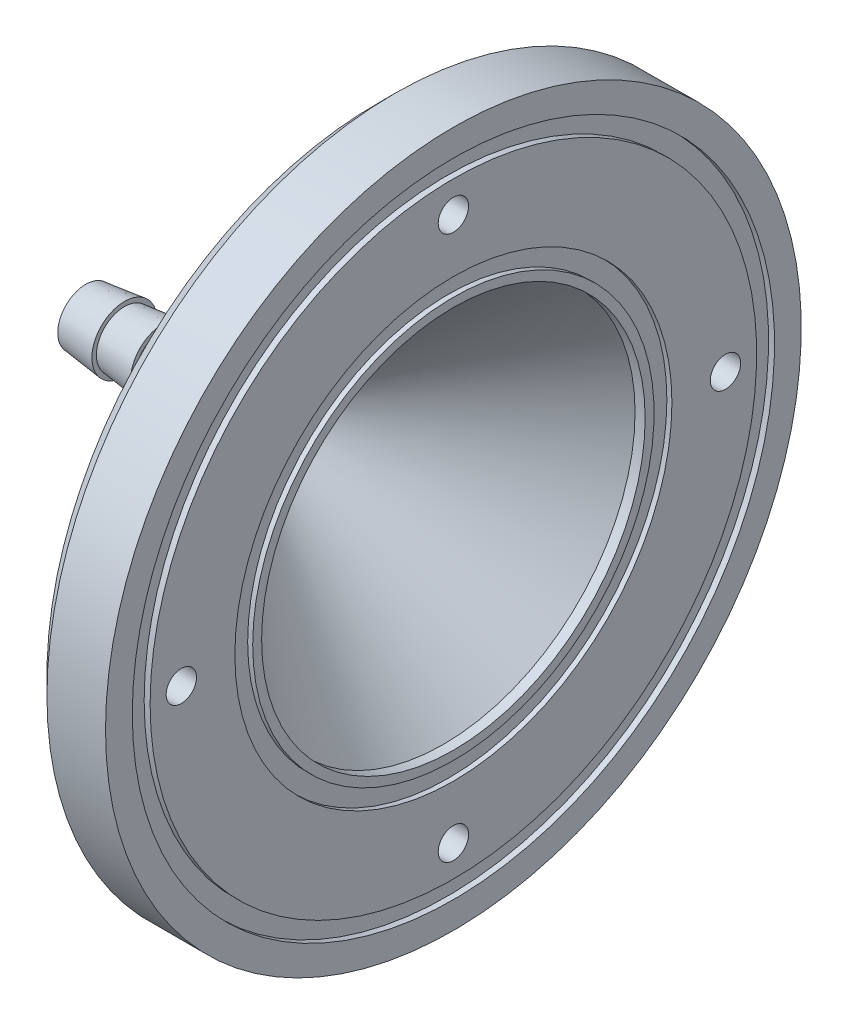
ISO-10303-21;
HEADER;
FILE_DESCRIPTION(('STEP AP214'),'2;1');
FILE_NAME('part.step','',(''),(''),'','','');
FILE_SCHEMA(('AUTOMOTIVE_DESIGN { 1 0 10303 214 1 1 1 1 }'));
ENDSEC;
DATA;
#1=APPLICATION_CONTEXT('core data for automotive mechanical design processes');
#2=APPLICATION_PROTOCOL_DEFINITION('international standard','automotive_design',2000,#1);
#3=PRODUCT_CONTEXT('',#1,'mechanical');
#4=PRODUCT('Part','Part','',(#3));
#5=PRODUCT_RELATED_PRODUCT_CATEGORY('part','',(#4));
#6=PRODUCT_DEFINITION_FORMATION('','',#4);
#7=PRODUCT_DEFINITION_CONTEXT('part definition',#1,'design');
#8=PRODUCT_DEFINITION('design','',#6,#7);
#9=PRODUCT_DEFINITION_SHAPE('','',#8);
#10=(LENGTH_UNIT() NAMED_UNIT(*) SI_UNIT(.MILLI.,.METRE.));
#11=(NAMED_UNIT(*) PLANE_ANGLE_UNIT() SI_UNIT($,.RADIAN.));
#12=(NAMED_UNIT(*) SI_UNIT($,.STERADIAN.) SOLID_ANGLE_UNIT());
#13=UNCERTAINTY_MEASURE_WITH_UNIT(LENGTH_MEASURE(1.E-05),#10,'distance_accuracy_value','');
#14=(GEOMETRIC_REPRESENTATION_CONTEXT(3) GLOBAL_UNCERTAINTY_ASSIGNED_CONTEXT((#13)) GLOBAL_UNIT_ASSIGNED_CONTEXT((#10,
#11,#12)) REPRESENTATION_CONTEXT('',''));
#15=CARTESIAN_POINT('',(0.,0.,0.));
#16=DIRECTION('',(0.,0.,1.));
#17=DIRECTION('',(1.,0.,0.));
#18=AXIS2_PLACEMENT_3D('',#15,#16,#17);
#19=CARTESIAN_POINT('',(22.0301153495263,0.,0.));
#20=DIRECTION('',(1.,0.,0.));
#21=DIRECTION('',(0.,0.,-1.));
#22=AXIS2_PLACEMENT_3D('',#19,#20,#21);
#23=PLANE('',#22);
#24=CARTESIAN_POINT('',(22.0301153495264,0.,0.));
#25=DIRECTION('',(-1.,0.,0.));
#26=DIRECTION('',(0.,0.,1.));
#27=AXIS2_PLACEMENT_3D('',#24,#25,#26);
#28=CIRCLE('',#27,34.);
#29=CARTESIAN_POINT('',(22.0301153495264,0.,34.));
#30=VERTEX_POINT('',#29);
#31=EDGE_CURVE('E115',#30,#30,#28,.T.);
#32=ORIENTED_EDGE('',*,*,#31,.T.);
#33=EDGE_LOOP('',(#32));
#34=FACE_BOUND('',#33,.T.);
#35=CARTESIAN_POINT('',(22.0301153495264,0.,0.));
#36=DIRECTION('',(-1.,0.,0.));
#37=DIRECTION('',(0.,0.,1.));
#38=AXIS2_PLACEMENT_3D('',#35,#36,#37);
#39=CIRCLE('',#38,36.);
#40=CARTESIAN_POINT('',(22.0301153495264,0.,36.));
#41=VERTEX_POINT('',#40);
#42=EDGE_CURVE('E55',#41,#41,#39,.T.);
#43=ORIENTED_EDGE('',*,*,#42,.F.);
#44=EDGE_LOOP('',(#43));
#45=FACE_BOUND('',#44,.T.);
#46=ADVANCED_FACE('F43',(#34,#45),#23,.T.);
#47=CARTESIAN_POINT('',(-801.920554309434,0.,0.));
#48=DIRECTION('',(-1.,0.,0.));
#49=DIRECTION('',(0.,0.,1.));
#50=AXIS2_PLACEMENT_3D('',#47,#48,#49);
#51=CYLINDRICAL_SURFACE('',#50,36.);
#52=CARTESIAN_POINT('',(22.6971153495263,0.,0.));
#53=DIRECTION('',(-1.,0.,0.));
#54=DIRECTION('',(0.,0.,1.));
#55=AXIS2_PLACEMENT_3D('',#52,#53,#54);
#56=CIRCLE('',#55,36.);
#57=CARTESIAN_POINT('',(22.6971153495263,0.,36.));
#58=VERTEX_POINT('',#57);
#59=EDGE_CURVE('E59',#58,#58,#56,.T.);
#60=ORIENTED_EDGE('',*,*,#59,.F.);
#61=EDGE_LOOP('',(#60));
#62=FACE_BOUND('',#61,.T.);
#63=ORIENTED_EDGE('',*,*,#42,.T.);
#64=EDGE_LOOP('',(#63));
#65=FACE_BOUND('',#64,.T.);
#66=ADVANCED_FACE('F237',(#62,#65),#51,.F.);
#67=CARTESIAN_POINT('',(22.6971153495264,0.,0.));
#68=DIRECTION('',(-1.,0.,0.));
#69=DIRECTION('',(0.,0.,1.));
#70=AXIS2_PLACEMENT_3D('',#67,#68,#69);
#71=PLANE('',#70);
#72=CARTESIAN_POINT('',(22.6971153495263,0.,0.));
#73=DIRECTION('',(-1.,0.,0.));
#74=DIRECTION('',(0.,0.,1.));
#75=AXIS2_PLACEMENT_3D('',#72,#73,#74);
#76=CIRCLE('',#75,39.);
#77=CARTESIAN_POINT('',(22.6971153495263,0.,39.));
#78=VERTEX_POINT('',#77);
#79=EDGE_CURVE('E64',#78,#78,#76,.T.);
#80=ORIENTED_EDGE('',*,*,#79,.F.);
#81=EDGE_LOOP('',(#80));
#82=FACE_BOUND('',#81,.T.);
#83=ORIENTED_EDGE('',*,*,#59,.T.);
#84=EDGE_LOOP('',(#83));
#85=FACE_BOUND('',#84,.T.);
#86=ADVANCED_FACE('F242',(#82,#85),#71,.F.);
#87=CARTESIAN_POINT('',(-801.920554309434,0.,0.));
#88=DIRECTION('',(-1.,0.,0.));
#89=DIRECTION('',(0.,0.,1.));
#90=AXIS2_PLACEMENT_3D('',#87,#88,#89);
#91=CYLINDRICAL_SURFACE('',#90,39.);
#92=CARTESIAN_POINT('',(16.1311153495265,0.,0.));
#93=DIRECTION('',(1.,0.,0.));
#94=DIRECTION('',(0.,0.,-1.));
#95=AXIS2_PLACEMENT_3D('',#92,#93,#94);
#96=CIRCLE('',#95,39.);
#97=CARTESIAN_POINT('',(16.1311153495265,0.,-39.));
#98=VERTEX_POINT('',#97);
#99=EDGE_CURVE('E10',#98,#98,#96,.T.);
#100=ORIENTED_EDGE('',*,*,#99,.T.);
#101=EDGE_LOOP('',(#100));
#102=FACE_BOUND('',#101,.T.);
#103=ORIENTED_EDGE('',*,*,#79,.T.);
#104=EDGE_LOOP('',(#103));
#105=FACE_BOUND('',#104,.T.);
#106=ADVANCED_FACE('F173',(#102,#105),#91,.T.);
#107=CARTESIAN_POINT('',(14.1311153495264,0.,0.));
#108=DIRECTION('',(1.,0.,0.));
#109=DIRECTION('',(0.,0.,-1.));
#110=AXIS2_PLACEMENT_3D('',#107,#108,#109);
#111=PLANE('',#110);
#112=CARTESIAN_POINT('',(14.1311153495264,0.,0.));
#113=DIRECTION('',(1.,0.,0.));
#114=DIRECTION('',(0.,0.,-1.));
#115=AXIS2_PLACEMENT_3D('',#112,#113,#114);
#116=CIRCLE('',#115,36.9999999999999);
#117=CARTESIAN_POINT('',(14.1311153495264,0.,-36.9999999999999));
#118=VERTEX_POINT('',#117);
#119=EDGE_CURVE('E51',#118,#118,#116,.F.);
#120=ORIENTED_EDGE('',*,*,#119,.T.);
#121=EDGE_LOOP('',(#120));
#122=FACE_BOUND('',#121,.T.);
#123=CARTESIAN_POINT('',(14.1311153495264,30.5,0.));
#124=DIRECTION('',(-1.,0.,0.));
#125=DIRECTION('',(0.,0.,1.));
#126=AXIS2_PLACEMENT_3D('',#123,#124,#125);
#127=CIRCLE('',#126,3.25);
#128=CARTESIAN_POINT('',(14.1311153495264,30.5,3.25));
#129=VERTEX_POINT('',#128);
#130=EDGE_CURVE('E163',#129,#129,#127,.T.);
#131=ORIENTED_EDGE('',*,*,#130,.F.);
#132=EDGE_LOOP('',(#131));
#133=FACE_BOUND('',#132,.T.);
#134=CARTESIAN_POINT('',(14.1311153495264,0.,30.5));
#135=DIRECTION('',(-1.,0.,0.));
#136=DIRECTION('',(0.,0.,1.));
#137=AXIS2_PLACEMENT_3D('',#134,#135,#136);
#138=CIRCLE('',#137,3.25);
#139=CARTESIAN_POINT('',(14.1311153495264,0.,33.75));
#140=VERTEX_POINT('',#139);
#141=EDGE_CURVE('E151',#140,#140,#138,.T.);
#142=ORIENTED_EDGE('',*,*,#141,.F.);
#143=EDGE_LOOP('',(#142));
#144=FACE_BOUND('',#143,.T.);
#145=CARTESIAN_POINT('',(14.1311153495264,0.,-30.5));
#146=DIRECTION('',(-1.,0.,0.));
#147=DIRECTION('',(0.,0.,1.));
#148=AXIS2_PLACEMENT_3D('',#145,#146,#147);
#149=CIRCLE('',#148,3.25);
#150=CARTESIAN_POINT('',(14.1311153495264,0.,-27.25));
#151=VERTEX_POINT('',#150);
#152=EDGE_CURVE('E139',#151,#151,#149,.T.);
#153=ORIENTED_EDGE('',*,*,#152,.F.);
#154=EDGE_LOOP('',(#153));
#155=FACE_BOUND('',#154,.T.);
#156=CARTESIAN_POINT('',(14.1311153495264,-30.5,0.));
#157=DIRECTION('',(-1.,0.,0.));
#158=DIRECTION('',(0.,0.,1.));
#159=AXIS2_PLACEMENT_3D('',#156,#157,#158);
#160=CIRCLE('',#159,3.25);
#161=CARTESIAN_POINT('',(14.1311153495264,-30.5,3.25));
#162=VERTEX_POINT('',#161);
#163=EDGE_CURVE('E127',#162,#162,#160,.T.);
#164=ORIENTED_EDGE('',*,*,#163,.F.);
#165=EDGE_LOOP('',(#164));
#166=FACE_BOUND('',#165,.T.);
#167=CARTESIAN_POINT('',(14.1311153495265,0.,0.));
#168=DIRECTION('',(-1.,0.,0.));
#169=DIRECTION('',(0.,0.,1.));
#170=AXIS2_PLACEMENT_3D('',#167,#168,#169);
#171=CIRCLE('',#170,21.5);
#172=CARTESIAN_POINT('',(14.1311153495265,0.,21.5));
#173=VERTEX_POINT('',#172);
#174=EDGE_CURVE('E67',#173,#173,#171,.T.);
#175=ORIENTED_EDGE('',*,*,#174,.F.);
#176=EDGE_LOOP('',(#175));
#177=FACE_BOUND('',#176,.T.);
#178=ADVANCED_FACE('F169',(#122,#133,#144,#155,#166,#177),#111,.F.);
#179=CARTESIAN_POINT('',(-5.50854327236361,0.,0.));
#180=DIRECTION('',(1.,0.,0.));
#181=DIRECTION('',(0.,0.,-1.));
#182=AXIS2_PLACEMENT_3D('',#179,#180,#181);
#183=CONICAL_SURFACE('',#182,3.65,0.737696981694734);
#184=ORIENTED_EDGE('',*,*,#174,.T.);
#185=EDGE_LOOP('',(#184));
#186=FACE_BOUND('',#185,.T.);
#187=CARTESIAN_POINT('',(-5.50854327236361,0.,0.));
#188=DIRECTION('',(-1.,0.,0.));
#189=DIRECTION('',(0.,0.,1.));
#190=AXIS2_PLACEMENT_3D('',#187,#188,#189);
#191=CIRCLE('',#190,3.65);
#192=CARTESIAN_POINT('',(-5.50854327236361,0.,3.65));
#193=VERTEX_POINT('',#192);
#194=EDGE_CURVE('E70',#193,#193,#191,.T.);
#195=ORIENTED_EDGE('',*,*,#194,.F.);
#196=EDGE_LOOP('',(#195));
#197=FACE_BOUND('',#196,.T.);
#198=ADVANCED_FACE('F172',(#186,#197),#183,.T.);
#199=CARTESIAN_POINT('',(-9.8418766056968,0.,0.));
#200=DIRECTION('',(1.,0.,0.));
#201=DIRECTION('',(0.,0.,-1.));
#202=AXIS2_PLACEMENT_3D('',#199,#200,#201);
#203=CONICAL_SURFACE('',#202,3.15,0.114876605416903);
#204=ORIENTED_EDGE('',*,*,#194,.T.);
#205=EDGE_LOOP('',(#204));
#206=FACE_BOUND('',#205,.T.);
#207=CARTESIAN_POINT('',(-9.8418766056968,0.,0.));
#208=DIRECTION('',(-1.,0.,0.));
#209=DIRECTION('',(0.,0.,1.));
#210=AXIS2_PLACEMENT_3D('',#207,#208,#209);
#211=CIRCLE('',#210,3.15);
#212=CARTESIAN_POINT('',(-9.8418766056968,0.,3.15));
#213=VERTEX_POINT('',#212);
#214=EDGE_CURVE('E73',#213,#213,#211,.T.);
#215=ORIENTED_EDGE('',*,*,#214,.F.);
#216=EDGE_LOOP('',(#215));
#217=FACE_BOUND('',#216,.T.);
#218=ADVANCED_FACE('F185',(#206,#217),#203,.T.);
#219=CARTESIAN_POINT('',(-9.84187660569685,0.,0.));
#220=DIRECTION('',(1.,0.,0.));
#221=DIRECTION('',(0.,0.,-1.));
#222=AXIS2_PLACEMENT_3D('',#219,#220,#221);
#223=PLANE('',#222);
#224=ORIENTED_EDGE('',*,*,#214,.T.);
#225=EDGE_LOOP('',(#224));
#226=FACE_BOUND('',#225,.T.);
#227=CARTESIAN_POINT('',(-9.8418766056968,0.,0.));
#228=DIRECTION('',(-1.,0.,0.));
#229=DIRECTION('',(0.,0.,1.));
#230=AXIS2_PLACEMENT_3D('',#227,#228,#229);
#231=CIRCLE('',#230,3.65);
#232=CARTESIAN_POINT('',(-9.8418766056968,0.,3.65));
#233=VERTEX_POINT('',#232);
#234=EDGE_CURVE('E76',#233,#233,#231,.T.);
#235=ORIENTED_EDGE('',*,*,#234,.F.);
#236=EDGE_LOOP('',(#235));
#237=FACE_BOUND('',#236,.T.);
#238=ADVANCED_FACE('F191',(#226,#237),#223,.T.);
#239=CARTESIAN_POINT('',(-14.1752099390302,0.,0.));
#240=DIRECTION('',(1.,0.,0.));
#241=DIRECTION('',(0.,0.,-1.));
#242=AXIS2_PLACEMENT_3D('',#239,#240,#241);
#243=CONICAL_SURFACE('',#242,3.15,0.114876605416897);
#244=ORIENTED_EDGE('',*,*,#234,.T.);
#245=EDGE_LOOP('',(#244));
#246=FACE_BOUND('',#245,.T.);
#247=CARTESIAN_POINT('',(-14.1752099390302,0.,0.));
#248=DIRECTION('',(-1.,0.,0.));
#249=DIRECTION('',(0.,0.,1.));
#250=AXIS2_PLACEMENT_3D('',#247,#248,#249);
#251=CIRCLE('',#250,3.15);
#252=CARTESIAN_POINT('',(-14.1752099390302,0.,3.15));
#253=VERTEX_POINT('',#252);
#254=EDGE_CURVE('E79',#253,#253,#251,.T.);
#255=ORIENTED_EDGE('',*,*,#254,.F.);
#256=EDGE_LOOP('',(#255));
#257=FACE_BOUND('',#256,.T.);
#258=ADVANCED_FACE('F197',(#246,#257),#243,.T.);
#259=CARTESIAN_POINT('',(-14.1752099390302,0.,0.));
#260=DIRECTION('',(1.,0.,0.));
#261=DIRECTION('',(0.,0.,-1.));
#262=AXIS2_PLACEMENT_3D('',#259,#260,#261);
#263=PLANE('',#262);
#264=ORIENTED_EDGE('',*,*,#254,.T.);
#265=EDGE_LOOP('',(#264));
#266=FACE_BOUND('',#265,.T.);
#267=CARTESIAN_POINT('',(-14.1752099390302,0.,0.));
#268=DIRECTION('',(-1.,0.,0.));
#269=DIRECTION('',(0.,0.,1.));
#270=AXIS2_PLACEMENT_3D('',#267,#268,#269);
#271=CIRCLE('',#270,3.65);
#272=CARTESIAN_POINT('',(-14.1752099390302,0.,3.65));
#273=VERTEX_POINT('',#272);
#274=EDGE_CURVE('E82',#273,#273,#271,.T.);
#275=ORIENTED_EDGE('',*,*,#274,.F.);
#276=EDGE_LOOP('',(#275));
#277=FACE_BOUND('',#276,.T.);
#278=ADVANCED_FACE('F203',(#266,#277),#263,.T.);
#279=CARTESIAN_POINT('',(-18.5085432723635,0.,0.));
#280=DIRECTION('',(1.,0.,0.));
#281=DIRECTION('',(0.,0.,-1.));
#282=AXIS2_PLACEMENT_3D('',#279,#280,#281);
#283=CONICAL_SURFACE('',#282,3.15,0.1148766054169);
#284=ORIENTED_EDGE('',*,*,#274,.T.);
#285=EDGE_LOOP('',(#284));
#286=FACE_BOUND('',#285,.T.);
#287=CARTESIAN_POINT('',(-18.5085432723635,0.,0.));
#288=DIRECTION('',(-1.,0.,0.));
#289=DIRECTION('',(0.,0.,1.));
#290=AXIS2_PLACEMENT_3D('',#287,#288,#289);
#291=CIRCLE('',#290,3.15);
#292=CARTESIAN_POINT('',(-18.5085432723635,0.,3.15));
#293=VERTEX_POINT('',#292);
#294=EDGE_CURVE('E85',#293,#293,#291,.T.);
#295=ORIENTED_EDGE('',*,*,#294,.F.);
#296=EDGE_LOOP('',(#295));
#297=FACE_BOUND('',#296,.T.);
#298=ADVANCED_FACE('F209',(#286,#297),#283,.T.);
#299=CARTESIAN_POINT('',(-18.5085432723635,0.,0.));
#300=DIRECTION('',(-1.,0.,0.));
#301=DIRECTION('',(0.,0.,1.));
#302=AXIS2_PLACEMENT_3D('',#299,#300,#301);
#303=PLANE('',#302);
#304=ORIENTED_EDGE('',*,*,#294,.T.);
#305=EDGE_LOOP('',(#304));
#306=FACE_BOUND('',#305,.T.);
#307=CARTESIAN_POINT('',(-18.5085432723635,0.,0.));
#308=DIRECTION('',(-1.,0.,0.));
#309=DIRECTION('',(0.,0.,1.));
#310=AXIS2_PLACEMENT_3D('',#307,#308,#309);
#311=CIRCLE('',#310,1.9);
#312=CARTESIAN_POINT('',(-18.5085432723635,0.,1.9));
#313=VERTEX_POINT('',#312);
#314=EDGE_CURVE('E88',#313,#313,#311,.T.);
#315=ORIENTED_EDGE('',*,*,#314,.F.);
#316=EDGE_LOOP('',(#315));
#317=FACE_BOUND('',#316,.T.);
#318=ADVANCED_FACE('F215',(#306,#317),#303,.T.);
#319=CARTESIAN_POINT('',(-801.920554309434,0.,0.));
#320=DIRECTION('',(-1.,0.,0.));
#321=DIRECTION('',(0.,0.,1.));
#322=AXIS2_PLACEMENT_3D('',#319,#320,#321);
#323=CYLINDRICAL_SURFACE('',#322,1.9);
#324=CARTESIAN_POINT('',(0.,0.,0.));
#325=DIRECTION('',(-1.,0.,0.));
#326=DIRECTION('',(0.,0.,1.));
#327=AXIS2_PLACEMENT_3D('',#324,#325,#326);
#328=CIRCLE('',#327,1.9);
#329=CARTESIAN_POINT('',(0.,0.,1.9));
#330=VERTEX_POINT('',#329);
#331=EDGE_CURVE('E91',#330,#330,#328,.T.);
#332=ORIENTED_EDGE('',*,*,#331,.F.);
#333=EDGE_LOOP('',(#332));
#334=FACE_BOUND('',#333,.T.);
#335=ORIENTED_EDGE('',*,*,#314,.T.);
#336=EDGE_LOOP('',(#335));
#337=FACE_BOUND('',#336,.T.);
#338=ADVANCED_FACE('F221',(#334,#337),#323,.F.);
#339=CARTESIAN_POINT('',(0.,0.,0.));
#340=DIRECTION('',(1.,0.,0.));
#341=DIRECTION('',(0.,0.,-1.));
#342=AXIS2_PLACEMENT_3D('',#339,#340,#341);
#343=CONICAL_SURFACE('',#342,1.9,0.737696981694736);
#344=CARTESIAN_POINT('',(21.5651153495263,0.,0.));
#345=DIRECTION('',(-1.,0.,0.));
#346=DIRECTION('',(0.,0.,1.));
#347=AXIS2_PLACEMENT_3D('',#344,#345,#346);
#348=CIRCLE('',#347,21.5);
#349=CARTESIAN_POINT('',(21.5651153495263,0.,21.5));
#350=VERTEX_POINT('',#349);
#351=EDGE_CURVE('E94',#350,#350,#348,.T.);
#352=ORIENTED_EDGE('',*,*,#351,.F.);
#353=EDGE_LOOP('',(#352));
#354=FACE_BOUND('',#353,.T.);
#355=ORIENTED_EDGE('',*,*,#331,.T.);
#356=EDGE_LOOP('',(#355));
#357=FACE_BOUND('',#356,.T.);
#358=ADVANCED_FACE('F226',(#354,#357),#343,.F.);
#359=CARTESIAN_POINT('',(-801.920554309434,0.,0.));
#360=DIRECTION('',(-1.,0.,0.));
#361=DIRECTION('',(0.,0.,1.));
#362=AXIS2_PLACEMENT_3D('',#359,#360,#361);
#363=CYLINDRICAL_SURFACE('',#362,21.5);
#364=CARTESIAN_POINT('',(22.6971153495263,0.,0.));
#365=DIRECTION('',(-1.,0.,0.));
#366=DIRECTION('',(0.,0.,1.));
#367=AXIS2_PLACEMENT_3D('',#364,#365,#366);
#368=CIRCLE('',#367,21.5);
#369=CARTESIAN_POINT('',(22.6971153495263,0.,21.5));
#370=VERTEX_POINT('',#369);
#371=EDGE_CURVE('E97',#370,#370,#368,.T.);
#372=ORIENTED_EDGE('',*,*,#371,.F.);
#373=EDGE_LOOP('',(#372));
#374=FACE_BOUND('',#373,.T.);
#375=ORIENTED_EDGE('',*,*,#351,.T.);
#376=EDGE_LOOP('',(#375));
#377=FACE_BOUND('',#376,.T.);
#378=ADVANCED_FACE('F232',(#374,#377),#363,.F.);
#379=CARTESIAN_POINT('',(22.6971153495263,0.,0.));
#380=DIRECTION('',(1.,0.,0.));
#381=DIRECTION('',(0.,0.,-1.));
#382=AXIS2_PLACEMENT_3D('',#379,#380,#381);
#383=PLANE('',#382);
#384=ORIENTED_EDGE('',*,*,#371,.T.);
#385=EDGE_LOOP('',(#384));
#386=FACE_BOUND('',#385,.T.);
#387=CARTESIAN_POINT('',(22.6971153495263,0.,0.));
#388=DIRECTION('',(-1.,0.,0.));
#389=DIRECTION('',(0.,0.,1.));
#390=AXIS2_PLACEMENT_3D('',#387,#388,#389);
#391=CIRCLE('',#390,22.5);
#392=CARTESIAN_POINT('',(22.6971153495263,0.,22.5));
#393=VERTEX_POINT('',#392);
#394=EDGE_CURVE('E100',#393,#393,#391,.T.);
#395=ORIENTED_EDGE('',*,*,#394,.F.);
#396=EDGE_LOOP('',(#395));
#397=FACE_BOUND('',#396,.T.);
#398=ADVANCED_FACE('F422',(#386,#397),#383,.T.);
#399=CARTESIAN_POINT('',(-801.920554309434,0.,0.));
#400=DIRECTION('',(-1.,0.,0.));
#401=DIRECTION('',(0.,0.,1.));
#402=AXIS2_PLACEMENT_3D('',#399,#400,#401);
#403=CYLINDRICAL_SURFACE('',#402,22.5);
#404=ORIENTED_EDGE('',*,*,#394,.T.);
#405=EDGE_LOOP('',(#404));
#406=FACE_BOUND('',#405,.T.);
#407=CARTESIAN_POINT('',(22.1311153495264,0.,0.));
#408=DIRECTION('',(-1.,0.,0.));
#409=DIRECTION('',(0.,0.,1.));
#410=AXIS2_PLACEMENT_3D('',#407,#408,#409);
#411=CIRCLE('',#410,22.5);
#412=CARTESIAN_POINT('',(22.1311153495264,0.,22.5));
#413=VERTEX_POINT('',#412);
#414=EDGE_CURVE('E103',#413,#413,#411,.T.);
#415=ORIENTED_EDGE('',*,*,#414,.F.);
#416=EDGE_LOOP('',(#415));
#417=FACE_BOUND('',#416,.T.);
#418=ADVANCED_FACE('F435',(#406,#417),#403,.T.);
#419=CARTESIAN_POINT('',(22.1311153495264,0.,0.));
#420=DIRECTION('',(1.,0.,0.));
#421=DIRECTION('',(0.,0.,-1.));
#422=AXIS2_PLACEMENT_3D('',#419,#420,#421);
#423=PLANE('',#422);
#424=ORIENTED_EDGE('',*,*,#414,.T.);
#425=EDGE_LOOP('',(#424));
#426=FACE_BOUND('',#425,.T.);
#427=CARTESIAN_POINT('',(22.1311153495264,0.,0.));
#428=DIRECTION('',(-1.,0.,0.));
#429=DIRECTION('',(0.,0.,1.));
#430=AXIS2_PLACEMENT_3D('',#427,#428,#429);
#431=CIRCLE('',#430,24.5);
#432=CARTESIAN_POINT('',(22.1311153495264,0.,24.5));
#433=VERTEX_POINT('',#432);
#434=EDGE_CURVE('E106',#433,#433,#431,.T.);
#435=ORIENTED_EDGE('',*,*,#434,.F.);
#436=EDGE_LOOP('',(#435));
#437=FACE_BOUND('',#436,.T.);
#438=ADVANCED_FACE('F276',(#426,#437),#423,.T.);
#439=CARTESIAN_POINT('',(-801.920554309434,0.,0.));
#440=DIRECTION('',(-1.,0.,0.));
#441=DIRECTION('',(0.,0.,1.));
#442=AXIS2_PLACEMENT_3D('',#439,#440,#441);
#443=CYLINDRICAL_SURFACE('',#442,24.5);
#444=ORIENTED_EDGE('',*,*,#434,.T.);
#445=EDGE_LOOP('',(#444));
#446=FACE_BOUND('',#445,.T.);
#447=CARTESIAN_POINT('',(22.6971153495263,0.,0.));
#448=DIRECTION('',(-1.,0.,0.));
#449=DIRECTION('',(0.,0.,1.));
#450=AXIS2_PLACEMENT_3D('',#447,#448,#449);
#451=CIRCLE('',#450,24.5);
#452=CARTESIAN_POINT('',(22.6971153495263,0.,24.5));
#453=VERTEX_POINT('',#452);
#454=EDGE_CURVE('E109',#453,#453,#451,.T.);
#455=ORIENTED_EDGE('',*,*,#454,.F.);
#456=EDGE_LOOP('',(#455));
#457=FACE_BOUND('',#456,.T.);
#458=ADVANCED_FACE('F267',(#446,#457),#443,.F.);
#459=CARTESIAN_POINT('',(22.6971153495264,30.5,0.));
#460=DIRECTION('',(-1.,0.,0.));
#461=DIRECTION('',(0.,0.,1.));
#462=AXIS2_PLACEMENT_3D('',#459,#460,#461);
#463=CIRCLE('',#462,1.7);
#464=CARTESIAN_POINT('',(22.6971153495264,30.5,1.7));
#465=VERTEX_POINT('',#464);
#466=EDGE_CURVE('E154',#465,#465,#463,.T.);
#467=ORIENTED_EDGE('',*,*,#466,.T.);
#468=EDGE_LOOP('',(#467));
#469=FACE_BOUND('',#468,.T.);
#470=CARTESIAN_POINT('',(22.6971153495264,0.,30.5));
#471=DIRECTION('',(-1.,0.,0.));
#472=DIRECTION('',(0.,0.,1.));
#473=AXIS2_PLACEMENT_3D('',#470,#471,#472);
#474=CIRCLE('',#473,1.7);
#475=CARTESIAN_POINT('',(22.6971153495264,0.,32.2));
#476=VERTEX_POINT('',#475);
#477=EDGE_CURVE('E142',#476,#476,#474,.T.);
#478=ORIENTED_EDGE('',*,*,#477,.T.);
#479=EDGE_LOOP('',(#478));
#480=FACE_BOUND('',#479,.T.);
#481=CARTESIAN_POINT('',(22.6971153495264,0.,-30.5));
#482=DIRECTION('',(-1.,0.,0.));
#483=DIRECTION('',(0.,0.,1.));
#484=AXIS2_PLACEMENT_3D('',#481,#482,#483);
#485=CIRCLE('',#484,1.7);
#486=CARTESIAN_POINT('',(22.6971153495264,0.,-28.8));
#487=VERTEX_POINT('',#486);
#488=EDGE_CURVE('E130',#487,#487,#485,.T.);
#489=ORIENTED_EDGE('',*,*,#488,.T.);
#490=EDGE_LOOP('',(#489));
#491=FACE_BOUND('',#490,.T.);
#492=CARTESIAN_POINT('',(22.6971153495264,-30.5,0.));
#493=DIRECTION('',(-1.,0.,0.));
#494=DIRECTION('',(0.,0.,1.));
#495=AXIS2_PLACEMENT_3D('',#492,#493,#494);
#496=CIRCLE('',#495,1.7);
#497=CARTESIAN_POINT('',(22.6971153495264,-30.5,1.7));
#498=VERTEX_POINT('',#497);
#499=EDGE_CURVE('E118',#498,#498,#496,.T.);
#500=ORIENTED_EDGE('',*,*,#499,.T.);
#501=EDGE_LOOP('',(#500));
#502=FACE_BOUND('',#501,.T.);
#503=CARTESIAN_POINT('',(22.6971153495263,0.,0.));
#504=DIRECTION('',(-1.,0.,0.));
#505=DIRECTION('',(0.,0.,1.));
#506=AXIS2_PLACEMENT_3D('',#503,#504,#505);
#507=CIRCLE('',#506,34.);
#508=CARTESIAN_POINT('',(22.6971153495263,0.,34.));
#509=VERTEX_POINT('',#508);
#510=EDGE_CURVE('E112',#509,#509,#507,.T.);
#511=ORIENTED_EDGE('',*,*,#510,.F.);
#512=EDGE_LOOP('',(#511));
#513=FACE_BOUND('',#512,.T.);
#514=ORIENTED_EDGE('',*,*,#454,.T.);
#515=EDGE_LOOP('',(#514));
#516=FACE_BOUND('',#515,.T.);
#517=ADVANCED_FACE('F254',(#469,#480,#491,#502,#513,#516),#71,.F.);
#518=CARTESIAN_POINT('',(-801.920554309434,0.,0.));
#519=DIRECTION('',(-1.,0.,0.));
#520=DIRECTION('',(0.,0.,1.));
#521=AXIS2_PLACEMENT_3D('',#518,#519,#520);
#522=CYLINDRICAL_SURFACE('',#521,34.);
#523=ORIENTED_EDGE('',*,*,#510,.T.);
#524=EDGE_LOOP('',(#523));
#525=FACE_BOUND('',#524,.T.);
#526=ORIENTED_EDGE('',*,*,#31,.F.);
#527=EDGE_LOOP('',(#526));
#528=FACE_BOUND('',#527,.T.);
#529=ADVANCED_FACE('F266',(#525,#528),#522,.T.);
#530=CARTESIAN_POINT('',(14.1311153495264,-30.5,0.));
#531=DIRECTION('',(-1.,0.,0.));
#532=DIRECTION('',(0.,0.,1.));
#533=AXIS2_PLACEMENT_3D('',#530,#531,#532);
#534=CYLINDRICAL_SURFACE('',#533,1.7);
#535=ORIENTED_EDGE('',*,*,#499,.F.);
#536=EDGE_LOOP('',(#535));
#537=FACE_BOUND('',#536,.T.);
#538=CARTESIAN_POINT('',(17.5311153495264,-30.5,0.));
#539=DIRECTION('',(-1.,0.,0.));
#540=DIRECTION('',(0.,0.,1.));
#541=AXIS2_PLACEMENT_3D('',#538,#539,#540);
#542=CIRCLE('',#541,1.7);
#543=CARTESIAN_POINT('',(17.5311153495264,-30.5,1.7));
#544=VERTEX_POINT('',#543);
#545=EDGE_CURVE('E121',#544,#544,#542,.T.);
#546=ORIENTED_EDGE('',*,*,#545,.T.);
#547=EDGE_LOOP('',(#546));
#548=FACE_BOUND('',#547,.T.);
#549=ADVANCED_FACE('F273',(#537,#548),#534,.F.);
#550=CARTESIAN_POINT('',(17.5311153495264,-28.8,0.));
#551=DIRECTION('',(1.,0.,0.));
#552=DIRECTION('',(0.,0.,-1.));
#553=AXIS2_PLACEMENT_3D('',#550,#551,#552);
#554=PLANE('',#553);
#555=ORIENTED_EDGE('',*,*,#545,.F.);
#556=EDGE_LOOP('',(#555));
#557=FACE_BOUND('',#556,.T.);
#558=CARTESIAN_POINT('',(17.5311153495264,-30.5,0.));
#559=DIRECTION('',(-1.,0.,0.));
#560=DIRECTION('',(0.,0.,1.));
#561=AXIS2_PLACEMENT_3D('',#558,#559,#560);
#562=CIRCLE('',#561,3.25);
#563=CARTESIAN_POINT('',(17.5311153495264,-30.5,3.25));
#564=VERTEX_POINT('',#563);
#565=EDGE_CURVE('E124',#564,#564,#562,.T.);
#566=ORIENTED_EDGE('',*,*,#565,.T.);
#567=EDGE_LOOP('',(#566));
#568=FACE_BOUND('',#567,.T.);
#569=ADVANCED_FACE('F294',(#557,#568),#554,.F.);
#570=CARTESIAN_POINT('',(14.1311153495264,-30.5,0.));
#571=DIRECTION('',(-1.,0.,0.));
#572=DIRECTION('',(0.,0.,1.));
#573=AXIS2_PLACEMENT_3D('',#570,#571,#572);
#574=CYLINDRICAL_SURFACE('',#573,3.25);
#575=ORIENTED_EDGE('',*,*,#565,.F.);
#576=EDGE_LOOP('',(#575));
#577=FACE_BOUND('',#576,.T.);
#578=ORIENTED_EDGE('',*,*,#163,.T.);
#579=EDGE_LOOP('',(#578));
#580=FACE_BOUND('',#579,.T.);
#581=ADVANCED_FACE('F300',(#577,#580),#574,.F.);
#582=CARTESIAN_POINT('',(14.1311153495264,0.,-30.5));
#583=DIRECTION('',(-1.,0.,0.));
#584=DIRECTION('',(0.,0.,1.));
#585=AXIS2_PLACEMENT_3D('',#582,#583,#584);
#586=CYLINDRICAL_SURFACE('',#585,1.7);
#587=ORIENTED_EDGE('',*,*,#488,.F.);
#588=EDGE_LOOP('',(#587));
#589=FACE_BOUND('',#588,.T.);
#590=CARTESIAN_POINT('',(17.5311153495264,0.,-30.5));
#591=DIRECTION('',(-1.,0.,0.));
#592=DIRECTION('',(0.,0.,1.));
#593=AXIS2_PLACEMENT_3D('',#590,#591,#592);
#594=CIRCLE('',#593,1.7);
#595=CARTESIAN_POINT('',(17.5311153495264,0.,-28.8));
#596=VERTEX_POINT('',#595);
#597=EDGE_CURVE('E133',#596,#596,#594,.T.);
#598=ORIENTED_EDGE('',*,*,#597,.T.);
#599=EDGE_LOOP('',(#598));
#600=FACE_BOUND('',#599,.T.);
#601=ADVANCED_FACE('F306',(#589,#600),#586,.F.);
#602=CARTESIAN_POINT('',(17.5311153495264,1.7,-30.5));
#603=DIRECTION('',(1.,0.,0.));
#604=DIRECTION('',(0.,0.,-1.));
#605=AXIS2_PLACEMENT_3D('',#602,#603,#604);
#606=PLANE('',#605);
#607=ORIENTED_EDGE('',*,*,#597,.F.);
#608=EDGE_LOOP('',(#607));
#609=FACE_BOUND('',#608,.T.);
#610=CARTESIAN_POINT('',(17.5311153495264,0.,-30.5));
#611=DIRECTION('',(-1.,0.,0.));
#612=DIRECTION('',(0.,0.,1.));
#613=AXIS2_PLACEMENT_3D('',#610,#611,#612);
#614=CIRCLE('',#613,3.25);
#615=CARTESIAN_POINT('',(17.5311153495264,0.,-27.25));
#616=VERTEX_POINT('',#615);
#617=EDGE_CURVE('E136',#616,#616,#614,.T.);
#618=ORIENTED_EDGE('',*,*,#617,.T.);
#619=EDGE_LOOP('',(#618));
#620=FACE_BOUND('',#619,.T.);
#621=ADVANCED_FACE('F311',(#609,#620),#606,.F.);
#622=CARTESIAN_POINT('',(14.1311153495264,0.,-30.5));
#623=DIRECTION('',(-1.,0.,0.));
#624=DIRECTION('',(0.,0.,1.));
#625=AXIS2_PLACEMENT_3D('',#622,#623,#624);
#626=CYLINDRICAL_SURFACE('',#625,3.25);
#627=ORIENTED_EDGE('',*,*,#617,.F.);
#628=EDGE_LOOP('',(#627));
#629=FACE_BOUND('',#628,.T.);
#630=ORIENTED_EDGE('',*,*,#152,.T.);
#631=EDGE_LOOP('',(#630));
#632=FACE_BOUND('',#631,.T.);
#633=ADVANCED_FACE('F317',(#629,#632),#626,.F.);
#634=CARTESIAN_POINT('',(14.1311153495264,0.,30.5));
#635=DIRECTION('',(-1.,0.,0.));
#636=DIRECTION('',(0.,0.,1.));
#637=AXIS2_PLACEMENT_3D('',#634,#635,#636);
#638=CYLINDRICAL_SURFACE('',#637,1.7);
#639=ORIENTED_EDGE('',*,*,#477,.F.);
#640=EDGE_LOOP('',(#639));
#641=FACE_BOUND('',#640,.T.);
#642=CARTESIAN_POINT('',(17.5311153495264,0.,30.5));
#643=DIRECTION('',(-1.,0.,0.));
#644=DIRECTION('',(0.,0.,1.));
#645=AXIS2_PLACEMENT_3D('',#642,#643,#644);
#646=CIRCLE('',#645,1.7);
#647=CARTESIAN_POINT('',(17.5311153495264,0.,32.2));
#648=VERTEX_POINT('',#647);
#649=EDGE_CURVE('E145',#648,#648,#646,.T.);
#650=ORIENTED_EDGE('',*,*,#649,.T.);
#651=EDGE_LOOP('',(#650));
#652=FACE_BOUND('',#651,.T.);
#653=ADVANCED_FACE('F321',(#641,#652),#638,.F.);
#654=CARTESIAN_POINT('',(17.5311153495264,1.7,30.5));
#655=DIRECTION('',(1.,0.,0.));
#656=DIRECTION('',(0.,0.,-1.));
#657=AXIS2_PLACEMENT_3D('',#654,#655,#656);
#658=PLANE('',#657);
#659=ORIENTED_EDGE('',*,*,#649,.F.);
#660=EDGE_LOOP('',(#659));
#661=FACE_BOUND('',#660,.T.);
#662=CARTESIAN_POINT('',(17.5311153495264,0.,30.5));
#663=DIRECTION('',(-1.,0.,0.));
#664=DIRECTION('',(0.,0.,1.));
#665=AXIS2_PLACEMENT_3D('',#662,#663,#664);
#666=CIRCLE('',#665,3.25);
#667=CARTESIAN_POINT('',(17.5311153495264,0.,33.75));
#668=VERTEX_POINT('',#667);
#669=EDGE_CURVE('E148',#668,#668,#666,.T.);
#670=ORIENTED_EDGE('',*,*,#669,.T.);
#671=EDGE_LOOP('',(#670));
#672=FACE_BOUND('',#671,.T.);
#673=ADVANCED_FACE('F325',(#661,#672),#658,.F.);
#674=CARTESIAN_POINT('',(14.1311153495264,0.,30.5));
#675=DIRECTION('',(-1.,0.,0.));
#676=DIRECTION('',(0.,0.,1.));
#677=AXIS2_PLACEMENT_3D('',#674,#675,#676);
#678=CYLINDRICAL_SURFACE('',#677,3.25);
#679=ORIENTED_EDGE('',*,*,#669,.F.);
#680=EDGE_LOOP('',(#679));
#681=FACE_BOUND('',#680,.T.);
#682=ORIENTED_EDGE('',*,*,#141,.T.);
#683=EDGE_LOOP('',(#682));
#684=FACE_BOUND('',#683,.T.);
#685=ADVANCED_FACE('F329',(#681,#684),#678,.F.);
#686=CARTESIAN_POINT('',(14.1311153495264,30.5,0.));
#687=DIRECTION('',(-1.,0.,0.));
#688=DIRECTION('',(0.,0.,1.));
#689=AXIS2_PLACEMENT_3D('',#686,#687,#688);
#690=CYLINDRICAL_SURFACE('',#689,1.7);
#691=ORIENTED_EDGE('',*,*,#466,.F.);
#692=EDGE_LOOP('',(#691));
#693=FACE_BOUND('',#692,.T.);
#694=CARTESIAN_POINT('',(17.5311153495264,30.5,0.));
#695=DIRECTION('',(-1.,0.,0.));
#696=DIRECTION('',(0.,0.,1.));
#697=AXIS2_PLACEMENT_3D('',#694,#695,#696);
#698=CIRCLE('',#697,1.7);
#699=CARTESIAN_POINT('',(17.5311153495264,30.5,1.7));
#700=VERTEX_POINT('',#699);
#701=EDGE_CURVE('E157',#700,#700,#698,.T.);
#702=ORIENTED_EDGE('',*,*,#701,.T.);
#703=EDGE_LOOP('',(#702));
#704=FACE_BOUND('',#703,.T.);
#705=ADVANCED_FACE('F333',(#693,#704),#690,.F.);
#706=CARTESIAN_POINT('',(17.5311153495264,32.2,0.));
#707=DIRECTION('',(1.,0.,0.));
#708=DIRECTION('',(0.,0.,-1.));
#709=AXIS2_PLACEMENT_3D('',#706,#707,#708);
#710=PLANE('',#709);
#711=ORIENTED_EDGE('',*,*,#701,.F.);
#712=EDGE_LOOP('',(#711));
#713=FACE_BOUND('',#712,.T.);
#714=CARTESIAN_POINT('',(17.5311153495264,30.5,0.));
#715=DIRECTION('',(-1.,0.,0.));
#716=DIRECTION('',(0.,0.,1.));
#717=AXIS2_PLACEMENT_3D('',#714,#715,#716);
#718=CIRCLE('',#717,3.25);
#719=CARTESIAN_POINT('',(17.5311153495264,30.5,3.25));
#720=VERTEX_POINT('',#719);
#721=EDGE_CURVE('E160',#720,#720,#718,.T.);
#722=ORIENTED_EDGE('',*,*,#721,.T.);
#723=EDGE_LOOP('',(#722));
#724=FACE_BOUND('',#723,.T.);
#725=ADVANCED_FACE('F337',(#713,#724),#710,.F.);
#726=CARTESIAN_POINT('',(14.1311153495264,30.5,0.));
#727=DIRECTION('',(-1.,0.,0.));
#728=DIRECTION('',(0.,0.,1.));
#729=AXIS2_PLACEMENT_3D('',#726,#727,#728);
#730=CYLINDRICAL_SURFACE('',#729,3.25);
#731=ORIENTED_EDGE('',*,*,#721,.F.);
#732=EDGE_LOOP('',(#731));
#733=FACE_BOUND('',#732,.T.);
#734=ORIENTED_EDGE('',*,*,#130,.T.);
#735=EDGE_LOOP('',(#734));
#736=FACE_BOUND('',#735,.T.);
#737=ADVANCED_FACE('F167',(#733,#736),#730,.F.);
#738=CARTESIAN_POINT('',(14.1311153495265,0.,0.));
#739=DIRECTION('',(1.,0.,0.));
#740=DIRECTION('',(0.,0.,-1.));
#741=AXIS2_PLACEMENT_3D('',#738,#739,#740);
#742=CONICAL_SURFACE('',#741,36.9999999999999,0.785398163397467);
#743=ORIENTED_EDGE('',*,*,#99,.F.);
#744=EDGE_LOOP('',(#743));
#745=FACE_BOUND('',#744,.T.);
#746=ORIENTED_EDGE('',*,*,#119,.F.);
#747=EDGE_LOOP('',(#746));
#748=FACE_BOUND('',#747,.T.);
#749=ADVANCED_FACE('F46',(#745,#748),#742,.T.);
#750=CLOSED_SHELL('',(#46,#66,#86,#106,#178,#198,#218,#238,#258,#278,#298,#318,#338,#358,#378,
#398,#418,#438,#458,#517,#529,#549,#569,#581,#601,#621,#633,#653,#673,#685,#705,#725,#737,#749));
#751=MANIFOLD_SOLID_BREP('B2',#750);
#752=ADVANCED_BREP_SHAPE_REPRESENTATION('',(#18,#751),#14);
#753=SHAPE_DEFINITION_REPRESENTATION(#9,#752);
ENDSEC;
END-ISO-10303-21;
